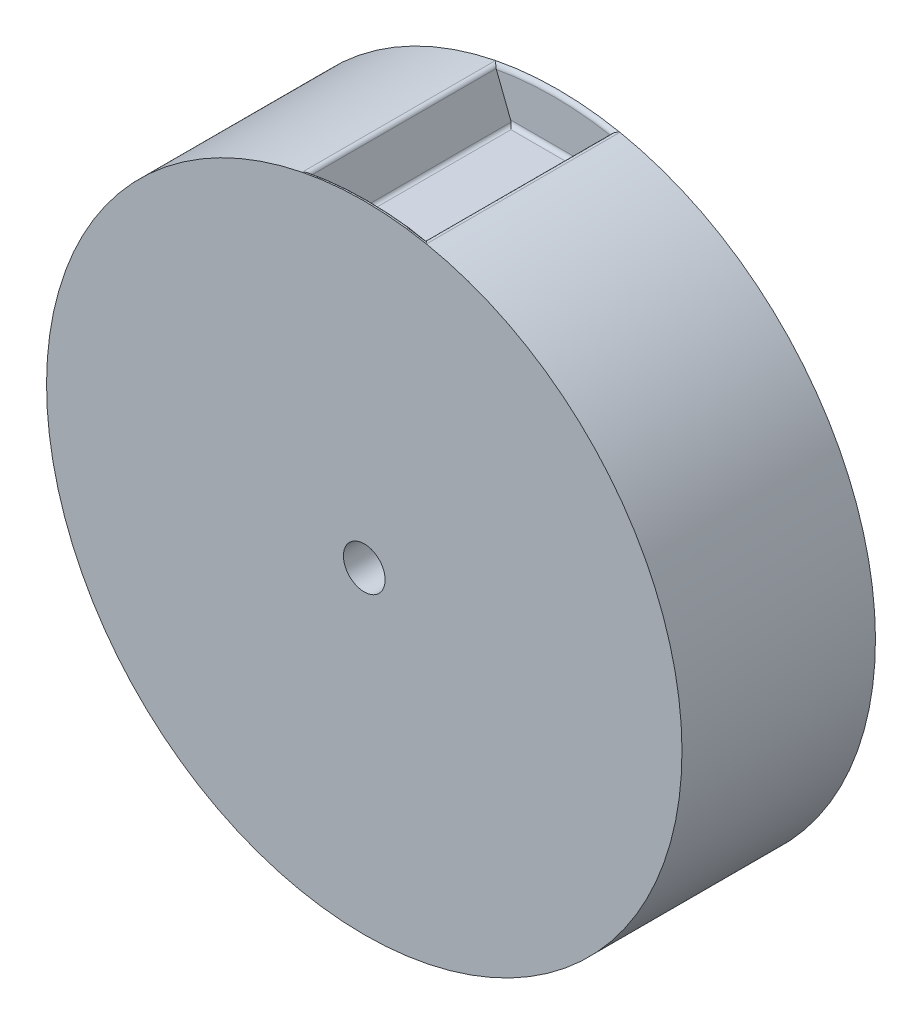
ISO-10303-21;
HEADER;
FILE_DESCRIPTION(('STEP AP214'),'2;1');
FILE_NAME('part.step','',(''),(''),'','','');
FILE_SCHEMA(('AUTOMOTIVE_DESIGN { 1 0 10303 214 1 1 1 1 }'));
ENDSEC;
DATA;
#1=APPLICATION_CONTEXT('core data for automotive mechanical design processes');
#2=APPLICATION_PROTOCOL_DEFINITION('international standard','automotive_design',2000,#1);
#3=PRODUCT_CONTEXT('',#1,'mechanical');
#4=PRODUCT('Part','Part','',(#3));
#5=PRODUCT_RELATED_PRODUCT_CATEGORY('part','',(#4));
#6=PRODUCT_DEFINITION_FORMATION('','',#4);
#7=PRODUCT_DEFINITION_CONTEXT('part definition',#1,'design');
#8=PRODUCT_DEFINITION('design','',#6,#7);
#9=PRODUCT_DEFINITION_SHAPE('','',#8);
#10=(LENGTH_UNIT() NAMED_UNIT(*) SI_UNIT(.MILLI.,.METRE.));
#11=(NAMED_UNIT(*) PLANE_ANGLE_UNIT() SI_UNIT($,.RADIAN.));
#12=(NAMED_UNIT(*) SI_UNIT($,.STERADIAN.) SOLID_ANGLE_UNIT());
#13=UNCERTAINTY_MEASURE_WITH_UNIT(LENGTH_MEASURE(1.E-05),#10,'distance_accuracy_value','');
#14=(GEOMETRIC_REPRESENTATION_CONTEXT(3) GLOBAL_UNCERTAINTY_ASSIGNED_CONTEXT((#13)) GLOBAL_UNIT_ASSIGNED_CONTEXT((#10,
#11,#12)) REPRESENTATION_CONTEXT('',''));
#15=CARTESIAN_POINT('',(0.,0.,0.));
#16=DIRECTION('',(0.,0.,1.));
#17=DIRECTION('',(1.,0.,0.));
#18=AXIS2_PLACEMENT_3D('',#15,#16,#17);
#19=CARTESIAN_POINT('',(0.,0.,22.2));
#20=DIRECTION('',(0.,0.,-1.));
#21=DIRECTION('',(-1.,0.,0.));
#22=AXIS2_PLACEMENT_3D('',#19,#20,#21);
#23=CYLINDRICAL_SURFACE('',#22,38.1);
#24=CARTESIAN_POINT('',(0.,0.,-0.5));
#25=DIRECTION('',(0.,0.,-1.));
#26=DIRECTION('',(-1.,0.,0.));
#27=AXIS2_PLACEMENT_3D('',#24,#25,#26);
#28=CIRCLE('',#27,38.1);
#29=CARTESIAN_POINT('',(7.45272481238406,37.3639785471365,-0.5));
#30=VERTEX_POINT('',#29);
#31=CARTESIAN_POINT('',(-7.45272481238408,37.3639785471365,-0.5));
#32=VERTEX_POINT('',#31);
#33=EDGE_CURVE('E334',#30,#32,#28,.T.);
#34=ORIENTED_EDGE('',*,*,#33,.F.);
#35=DIRECTION('',(0.,0.,-1.));
#36=VECTOR('',#35,1.);
#37=CARTESIAN_POINT('',(7.45272481238406,37.3639785471365,22.2));
#38=LINE('',#37,#36);
#39=CARTESIAN_POINT('',(7.45272481238403,37.3639785471363,22.7));
#40=VERTEX_POINT('',#39);
#41=EDGE_CURVE('E212',#30,#40,#38,.F.);
#42=ORIENTED_EDGE('',*,*,#41,.T.);
#43=CARTESIAN_POINT('',(0.,0.,22.7));
#44=DIRECTION('',(0.,0.,1.));
#45=DIRECTION('',(1.,0.,0.));
#46=AXIS2_PLACEMENT_3D('',#43,#44,#45);
#47=CIRCLE('',#46,38.0999999999999);
#48=CARTESIAN_POINT('',(-7.45272481238405,37.3639785471363,22.7));
#49=VERTEX_POINT('',#48);
#50=EDGE_CURVE('E341',#49,#40,#47,.T.);
#51=ORIENTED_EDGE('',*,*,#50,.F.);
#52=DIRECTION('',(0.,0.,-1.));
#53=VECTOR('',#52,1.);
#54=CARTESIAN_POINT('',(-7.45272481238408,37.3639785471365,22.2));
#55=LINE('',#54,#53);
#56=EDGE_CURVE('E209',#49,#32,#55,.T.);
#57=ORIENTED_EDGE('',*,*,#56,.T.);
#58=EDGE_LOOP('',(#34,#42,#51,#57));
#59=FACE_BOUND('',#58,.T.);
#60=ADVANCED_FACE('F41',(#59),#23,.T.);
#61=CARTESIAN_POINT('',(0.,0.,0.));
#62=DIRECTION('',(0.,0.,1.));
#63=DIRECTION('',(1.,0.,0.));
#64=AXIS2_PLACEMENT_3D('',#61,#62,#63);
#65=CYLINDRICAL_SURFACE('',#64,2.5);
#66=CARTESIAN_POINT('',(0.,0.,-0.5));
#67=DIRECTION('',(0.,0.,-1.));
#68=DIRECTION('',(-1.,0.,0.));
#69=AXIS2_PLACEMENT_3D('',#66,#67,#68);
#70=CIRCLE('',#69,2.50000000000008);
#71=CARTESIAN_POINT('',(-2.50000000000008,0.,-0.5));
#72=VERTEX_POINT('',#71);
#73=EDGE_CURVE('E335',#72,#72,#70,.T.);
#74=ORIENTED_EDGE('',*,*,#73,.T.);
#75=EDGE_LOOP('',(#74));
#76=FACE_BOUND('',#75,.T.);
#77=CARTESIAN_POINT('',(0.,0.,22.7));
#78=DIRECTION('',(0.,0.,1.));
#79=DIRECTION('',(1.,0.,0.));
#80=AXIS2_PLACEMENT_3D('',#77,#78,#79);
#81=CIRCLE('',#80,2.5);
#82=CARTESIAN_POINT('',(2.49999999999999,0.,22.7));
#83=VERTEX_POINT('',#82);
#84=EDGE_CURVE('E261',#83,#83,#81,.T.);
#85=ORIENTED_EDGE('',*,*,#84,.T.);
#86=EDGE_LOOP('',(#85));
#87=FACE_BOUND('',#86,.T.);
#88=ADVANCED_FACE('F360',(#76,#87),#65,.F.);
#89=CARTESIAN_POINT('',(7.04072332355369,37.4438007563491,-165.282496159998));
#90=DIRECTION('',(-0.93155768306813,0.363593568585499,0.));
#91=DIRECTION('',(-0.363593568585499,-0.93155768306813,0.));
#92=AXIS2_PLACEMENT_3D('',#89,#90,#91);
#93=PLANE('',#92);
#94=CARTESIAN_POINT('',(6.85568313824751,36.9697120452398,22.2));
#95=CARTESIAN_POINT('',(6.8613040944813,36.9841134137408,22.2000023833874));
#96=CARTESIAN_POINT('',(6.86690274277895,36.9984576274098,22.2006900906611));
#97=CARTESIAN_POINT('',(6.87805542446613,37.0270317475542,22.2034361532184));
#98=CARTESIAN_POINT('',(6.88360945784794,37.0412616540098,22.205494508739));
#99=CARTESIAN_POINT('',(6.8891411832859,37.0554344056138,22.2082381883827));
#100=B_SPLINE_CURVE_WITH_KNOTS('',3,(#94,#95,#96,#97,#98,#99),.UNSPECIFIED.,.F.,.F.,(4,2,4),(0.,
0.046240333352358,0.0924806746997725),.UNSPECIFIED.);
#101=CARTESIAN_POINT('',(6.85568313824751,36.9697120452398,22.2));
#102=VERTEX_POINT('',#101);
#103=CARTESIAN_POINT('',(6.8891411832859,37.0554344056138,22.2082381883827));
#104=VERTEX_POINT('',#103);
#105=EDGE_CURVE('E224',#102,#104,#100,.T.);
#106=ORIENTED_EDGE('',*,*,#105,.T.);
#107=DIRECTION('',(0.,0.,1.));
#108=VECTOR('',#107,1.);
#109=CARTESIAN_POINT('',(6.8891411832859,37.0554344056138,0.));
#110=LINE('',#109,#108);
#111=CARTESIAN_POINT('',(6.8891411832859,37.0554344056138,-0.00823818838274421));
#112=VERTEX_POINT('',#111);
#113=EDGE_CURVE('E71',#104,#112,#110,.F.);
#114=ORIENTED_EDGE('',*,*,#113,.T.);
#115=CARTESIAN_POINT('',(6.8891411832859,37.0554344056138,-0.00823818838274421));
#116=CARTESIAN_POINT('',(6.88360945784794,37.0412616540098,-0.00549450873897013));
#117=CARTESIAN_POINT('',(6.87805542446613,37.0270317475542,-0.00343615321840758));
#118=CARTESIAN_POINT('',(6.86690274277896,36.9984576274098,-0.000690090661105329));
#119=CARTESIAN_POINT('',(6.86130409448131,36.9841134137408,-2.38338737790063E-06));
#120=CARTESIAN_POINT('',(6.85568313824752,36.9697120452398,1.25728203115433E-13));
#121=B_SPLINE_CURVE_WITH_KNOTS('',3,(#115,#116,#117,#118,#119,#120),.UNSPECIFIED.,.F.,.F.,(4,2,
4),(0.,0.0462403413474005,0.092480674699756),.UNSPECIFIED.);
#122=CARTESIAN_POINT('',(6.85568313824751,36.9697120452398,0.));
#123=VERTEX_POINT('',#122);
#124=EDGE_CURVE('E56',#112,#123,#121,.T.);
#125=ORIENTED_EDGE('',*,*,#124,.T.);
#126=DIRECTION('',(-0.363593568585499,-0.93155768306813,0.));
#127=VECTOR('',#126,1.);
#128=CARTESIAN_POINT('',(-6.57259147563583,2.56532905360224,0.));
#129=LINE('',#128,#127);
#130=CARTESIAN_POINT('',(5.15015354507515,32.6,0.));
#131=VERTEX_POINT('',#130);
#132=EDGE_CURVE('E161',#123,#131,#129,.T.);
#133=ORIENTED_EDGE('',*,*,#132,.T.);
#134=CARTESIAN_POINT('',(5.15015354507515,32.6,0.5));
#135=DIRECTION('',(-0.93155768306813,0.363593568585499,0.));
#136=DIRECTION('',(-0.363593568585499,-0.93155768306813,0.));
#137=AXIS2_PLACEMENT_3D('',#134,#135,#136);
#138=ELLIPSE('',#137,0.536735415410054,0.5);
#139=CARTESIAN_POINT('',(5.07919697119916,32.4182032157073,0.0342211584659358));
#140=VERTEX_POINT('',#139);
#141=EDGE_CURVE('E197',#131,#140,#138,.T.);
#142=ORIENTED_EDGE('',*,*,#141,.T.);
#143=DIRECTION('',(0.,0.,1.));
#144=VECTOR('',#143,1.);
#145=CARTESIAN_POINT('',(5.07919697119916,32.4182032157073,22.2));
#146=LINE('',#145,#144);
#147=CARTESIAN_POINT('',(5.07919697119916,32.4182032157073,22.1657788415341));
#148=VERTEX_POINT('',#147);
#149=EDGE_CURVE('E191',#140,#148,#146,.T.);
#150=ORIENTED_EDGE('',*,*,#149,.T.);
#151=CARTESIAN_POINT('',(5.15015354507515,32.6,21.7));
#152=DIRECTION('',(-0.93155768306813,0.363593568585499,0.));
#153=DIRECTION('',(-0.363593568585499,-0.93155768306813,0.));
#154=AXIS2_PLACEMENT_3D('',#151,#152,#153);
#155=ELLIPSE('',#154,0.536735415410054,0.5);
#156=CARTESIAN_POINT('',(5.15015354507515,32.6,22.2));
#157=VERTEX_POINT('',#156);
#158=EDGE_CURVE('E194',#148,#157,#155,.T.);
#159=ORIENTED_EDGE('',*,*,#158,.T.);
#160=DIRECTION('',(-0.363593568585499,-0.93155768306813,0.));
#161=VECTOR('',#160,1.);
#162=CARTESIAN_POINT('',(-6.57259147563583,2.56532905360224,22.2));
#163=LINE('',#162,#161);
#164=EDGE_CURVE('E306',#102,#157,#163,.T.);
#165=ORIENTED_EDGE('',*,*,#164,.F.);
#166=EDGE_LOOP('',(#106,#114,#125,#133,#142,#150,#159,#165));
#167=FACE_BOUND('',#166,.T.);
#168=ADVANCED_FACE('F304',(#167),#93,.T.);
#169=CARTESIAN_POINT('',(4.95499999999999,32.1,-165.282496159998));
#170=DIRECTION('',(0.,1.,0.));
#171=DIRECTION('',(0.,0.,1.));
#172=AXIS2_PLACEMENT_3D('',#169,#170,#171);
#173=PLANE('',#172);
#174=DIRECTION('',(-1.,0.,0.));
#175=VECTOR('',#174,1.);
#176=CARTESIAN_POINT('',(4.95499999999999,32.1,21.7));
#177=LINE('',#176,#175);
#178=CARTESIAN_POINT('',(-4.61341812966513,32.1,21.7));
#179=VERTEX_POINT('',#178);
#180=CARTESIAN_POINT('',(4.61341812966509,32.1,21.7));
#181=VERTEX_POINT('',#180);
#182=EDGE_CURVE('E160',#179,#181,#177,.F.);
#183=ORIENTED_EDGE('',*,*,#182,.T.);
#184=DIRECTION('',(0.,0.,1.));
#185=VECTOR('',#184,1.);
#186=CARTESIAN_POINT('',(4.61341812966509,32.1,0.));
#187=LINE('',#186,#185);
#188=CARTESIAN_POINT('',(4.61341812966509,32.1,0.5));
#189=VERTEX_POINT('',#188);
#190=EDGE_CURVE('E165',#181,#189,#187,.F.);
#191=ORIENTED_EDGE('',*,*,#190,.T.);
#192=DIRECTION('',(-1.,0.,0.));
#193=VECTOR('',#192,1.);
#194=CARTESIAN_POINT('',(4.95499999999999,32.1,0.5));
#195=LINE('',#194,#193);
#196=CARTESIAN_POINT('',(-4.61341812966513,32.1,0.5));
#197=VERTEX_POINT('',#196);
#198=EDGE_CURVE('E144',#189,#197,#195,.T.);
#199=ORIENTED_EDGE('',*,*,#198,.T.);
#200=DIRECTION('',(0.,0.,1.));
#201=VECTOR('',#200,1.);
#202=CARTESIAN_POINT('',(-4.61341812966513,32.1,22.2));
#203=LINE('',#202,#201);
#204=EDGE_CURVE('E153',#197,#179,#203,.T.);
#205=ORIENTED_EDGE('',*,*,#204,.T.);
#206=EDGE_LOOP('',(#183,#191,#199,#205));
#207=FACE_BOUND('',#206,.T.);
#208=ADVANCED_FACE('F163',(#207),#173,.T.);
#209=CARTESIAN_POINT('',(-4.95500000000002,32.1,-165.282496159998));
#210=DIRECTION('',(0.93155768306813,0.363593568585498,0.));
#211=DIRECTION('',(-0.363593568585498,0.93155768306813,0.));
#212=AXIS2_PLACEMENT_3D('',#209,#210,#211);
#213=PLANE('',#212);
#214=CARTESIAN_POINT('',(-6.85568313824753,36.9697120452398,0.));
#215=CARTESIAN_POINT('',(-6.86130409448132,36.9841134137408,-2.38338744071117E-06));
#216=CARTESIAN_POINT('',(-6.86690274277897,36.9984576274098,-0.000690090661126024));
#217=CARTESIAN_POINT('',(-6.87805542446615,37.0270317475542,-0.00343615321838601));
#218=CARTESIAN_POINT('',(-6.88360945784796,37.0412616540098,-0.00549450873894877));
#219=CARTESIAN_POINT('',(-6.88914118328592,37.0554344056138,-0.00823818838274422));
#220=B_SPLINE_CURVE_WITH_KNOTS('',3,(#214,#215,#216,#217,#218,#219),.UNSPECIFIED.,.F.,.F.,(4,2,
4),(0.,0.0462403333523576,0.0924806746997723),.UNSPECIFIED.);
#221=CARTESIAN_POINT('',(-6.85568313824753,36.9697120452398,0.));
#222=VERTEX_POINT('',#221);
#223=CARTESIAN_POINT('',(-6.88914118328592,37.0554344056138,-0.0082381883827442));
#224=VERTEX_POINT('',#223);
#225=EDGE_CURVE('E11',#222,#224,#220,.T.);
#226=ORIENTED_EDGE('',*,*,#225,.T.);
#227=DIRECTION('',(0.,0.,1.));
#228=VECTOR('',#227,1.);
#229=CARTESIAN_POINT('',(-6.88914118328592,37.0554344056138,22.2));
#230=LINE('',#229,#228);
#231=CARTESIAN_POINT('',(-6.88914118328592,37.0554344056138,22.2082381883827));
#232=VERTEX_POINT('',#231);
#233=EDGE_CURVE('E64',#224,#232,#230,.T.);
#234=ORIENTED_EDGE('',*,*,#233,.T.);
#235=CARTESIAN_POINT('',(-6.88914118328592,37.0554344056138,22.2082381883827));
#236=CARTESIAN_POINT('',(-6.88360945784796,37.0412616540098,22.205494508739));
#237=CARTESIAN_POINT('',(-6.87805542446615,37.0270317475542,22.2034361532184));
#238=CARTESIAN_POINT('',(-6.86690274277898,36.9984576274098,22.2006900906611));
#239=CARTESIAN_POINT('',(-6.86130409448133,36.9841134137408,22.2000023833874));
#240=CARTESIAN_POINT('',(-6.85568313824754,36.9697120452398,22.1999999999999));
#241=B_SPLINE_CURVE_WITH_KNOTS('',3,(#235,#236,#237,#238,#239,#240),.UNSPECIFIED.,.F.,.F.,(4,2,
4),(0.,0.0462403413474004,0.092480674699756),.UNSPECIFIED.);
#242=CARTESIAN_POINT('',(-6.85568313824753,36.9697120452398,22.2));
#243=VERTEX_POINT('',#242);
#244=EDGE_CURVE('E215',#232,#243,#241,.T.);
#245=ORIENTED_EDGE('',*,*,#244,.T.);
#246=DIRECTION('',(-0.363593568585498,0.93155768306813,0.));
#247=VECTOR('',#246,1.);
#248=CARTESIAN_POINT('',(6.57259147563576,2.56532905360221,22.2));
#249=LINE('',#248,#247);
#250=CARTESIAN_POINT('',(-5.15015354507518,32.6,22.2));
#251=VERTEX_POINT('',#250);
#252=EDGE_CURVE('E324',#251,#243,#249,.T.);
#253=ORIENTED_EDGE('',*,*,#252,.F.);
#254=CARTESIAN_POINT('',(-5.15015354507518,32.6,21.7));
#255=DIRECTION('',(0.93155768306813,0.363593568585498,0.));
#256=DIRECTION('',(-0.363593568585498,0.93155768306813,0.));
#257=AXIS2_PLACEMENT_3D('',#254,#255,#256);
#258=ELLIPSE('',#257,0.536735415410054,0.5);
#259=CARTESIAN_POINT('',(-5.07919697119919,32.4182032157073,22.1657788415341));
#260=VERTEX_POINT('',#259);
#261=EDGE_CURVE('E177',#251,#260,#258,.T.);
#262=ORIENTED_EDGE('',*,*,#261,.T.);
#263=DIRECTION('',(0.,0.,1.));
#264=VECTOR('',#263,1.);
#265=CARTESIAN_POINT('',(-5.07919697119919,32.4182032157073,0.));
#266=LINE('',#265,#264);
#267=CARTESIAN_POINT('',(-5.07919697119919,32.4182032157073,0.0342211584659346));
#268=VERTEX_POINT('',#267);
#269=EDGE_CURVE('E171',#260,#268,#266,.F.);
#270=ORIENTED_EDGE('',*,*,#269,.T.);
#271=CARTESIAN_POINT('',(-5.15015354507518,32.6,0.5));
#272=DIRECTION('',(0.93155768306813,0.363593568585498,0.));
#273=DIRECTION('',(-0.363593568585498,0.93155768306813,0.));
#274=AXIS2_PLACEMENT_3D('',#271,#272,#273);
#275=ELLIPSE('',#274,0.536735415410054,0.5);
#276=CARTESIAN_POINT('',(-5.15015354507518,32.6,0.));
#277=VERTEX_POINT('',#276);
#278=EDGE_CURVE('E146',#268,#277,#275,.T.);
#279=ORIENTED_EDGE('',*,*,#278,.T.);
#280=DIRECTION('',(-0.363593568585498,0.93155768306813,0.));
#281=VECTOR('',#280,1.);
#282=CARTESIAN_POINT('',(6.57259147563576,2.56532905360221,0.));
#283=LINE('',#282,#281);
#284=EDGE_CURVE('E317',#277,#222,#283,.T.);
#285=ORIENTED_EDGE('',*,*,#284,.T.);
#286=EDGE_LOOP('',(#226,#234,#245,#253,#262,#270,#279,#285));
#287=FACE_BOUND('',#286,.T.);
#288=ADVANCED_FACE('F234',(#287),#213,.T.);
#289=CARTESIAN_POINT('',(0.,0.,-0.5));
#290=DIRECTION('',(0.,0.,-1.));
#291=DIRECTION('',(-1.,0.,0.));
#292=AXIS2_PLACEMENT_3D('',#289,#290,#291);
#293=PLANE('',#292);
#294=EDGE_CURVE('E330',#32,#30,#28,.T.);
#295=ORIENTED_EDGE('',*,*,#294,.T.);
#296=ORIENTED_EDGE('',*,*,#33,.T.);
#297=EDGE_LOOP('',(#295,#296));
#298=FACE_BOUND('',#297,.T.);
#299=ORIENTED_EDGE('',*,*,#73,.F.);
#300=EDGE_LOOP('',(#299));
#301=FACE_BOUND('',#300,.T.);
#302=ADVANCED_FACE('F239',(#298,#301),#293,.T.);
#303=CARTESIAN_POINT('',(0.,0.,0.));
#304=DIRECTION('',(0.,0.,-1.));
#305=DIRECTION('',(-1.,0.,0.));
#306=AXIS2_PLACEMENT_3D('',#303,#304,#305);
#307=PLANE('',#306);
#308=ORIENTED_EDGE('',*,*,#284,.F.);
#309=DIRECTION('',(-1.,0.,0.));
#310=VECTOR('',#309,1.);
#311=CARTESIAN_POINT('',(0.,32.6,0.));
#312=LINE('',#311,#310);
#313=EDGE_CURVE('E187',#277,#131,#312,.F.);
#314=ORIENTED_EDGE('',*,*,#313,.T.);
#315=ORIENTED_EDGE('',*,*,#132,.F.);
#316=CARTESIAN_POINT('',(0.,0.,0.));
#317=DIRECTION('',(0.,0.,-1.));
#318=DIRECTION('',(-1.,0.,0.));
#319=AXIS2_PLACEMENT_3D('',#316,#317,#318);
#320=CIRCLE('',#319,37.6);
#321=EDGE_CURVE('E184',#123,#222,#320,.F.);
#322=ORIENTED_EDGE('',*,*,#321,.T.);
#323=EDGE_LOOP('',(#308,#314,#315,#322));
#324=FACE_BOUND('',#323,.T.);
#325=ADVANCED_FACE('F241',(#324),#307,.F.);
#326=CARTESIAN_POINT('',(0.,0.,22.2));
#327=DIRECTION('',(0.,0.,1.));
#328=DIRECTION('',(1.,0.,0.));
#329=AXIS2_PLACEMENT_3D('',#326,#327,#328);
#330=PLANE('',#329);
#331=ORIENTED_EDGE('',*,*,#164,.T.);
#332=DIRECTION('',(-1.,0.,0.));
#333=VECTOR('',#332,1.);
#334=CARTESIAN_POINT('',(0.,32.6,22.2));
#335=LINE('',#334,#333);
#336=EDGE_CURVE('E206',#157,#251,#335,.T.);
#337=ORIENTED_EDGE('',*,*,#336,.T.);
#338=ORIENTED_EDGE('',*,*,#252,.T.);
#339=CARTESIAN_POINT('',(0.,0.,22.2));
#340=DIRECTION('',(0.,0.,1.));
#341=DIRECTION('',(1.,0.,0.));
#342=AXIS2_PLACEMENT_3D('',#339,#340,#341);
#343=CIRCLE('',#342,37.6);
#344=EDGE_CURVE('E202',#243,#102,#343,.F.);
#345=ORIENTED_EDGE('',*,*,#344,.T.);
#346=EDGE_LOOP('',(#331,#337,#338,#345));
#347=FACE_BOUND('',#346,.T.);
#348=ADVANCED_FACE('F386',(#347),#330,.F.);
#349=CARTESIAN_POINT('',(0.,0.,22.7));
#350=DIRECTION('',(0.,0.,1.));
#351=DIRECTION('',(1.,0.,0.));
#352=AXIS2_PLACEMENT_3D('',#349,#350,#351);
#353=PLANE('',#352);
#354=EDGE_CURVE('E299',#40,#49,#47,.T.);
#355=ORIENTED_EDGE('',*,*,#354,.T.);
#356=ORIENTED_EDGE('',*,*,#50,.T.);
#357=EDGE_LOOP('',(#355,#356));
#358=FACE_BOUND('',#357,.T.);
#359=ORIENTED_EDGE('',*,*,#84,.F.);
#360=EDGE_LOOP('',(#359));
#361=FACE_BOUND('',#360,.T.);
#362=ADVANCED_FACE('F350',(#358,#361),#353,.T.);
#363=CARTESIAN_POINT('',(0.,32.6,21.7));
#364=DIRECTION('',(-1.,0.,0.));
#365=DIRECTION('',(0.,0.,1.));
#366=AXIS2_PLACEMENT_3D('',#363,#364,#365);
#367=CYLINDRICAL_SURFACE('',#366,0.5);
#368=ORIENTED_EDGE('',*,*,#336,.F.);
#369=ORIENTED_EDGE('',*,*,#158,.F.);
#370=CARTESIAN_POINT('',(4.61341812966509,32.6,21.7));
#371=DIRECTION('',(-0.707106781186547,0.,0.707106781186547));
#372=DIRECTION('',(-0.707106781186547,0.,-0.707106781186547));
#373=AXIS2_PLACEMENT_3D('',#370,#371,#372);
#374=ELLIPSE('',#373,0.707106781186547,0.5);
#375=EDGE_CURVE('E257',#181,#148,#374,.T.);
#376=ORIENTED_EDGE('',*,*,#375,.F.);
#377=ORIENTED_EDGE('',*,*,#182,.F.);
#378=CARTESIAN_POINT('',(-4.61341812966513,32.6,21.7));
#379=DIRECTION('',(-0.707106781186547,0.,-0.707106781186547));
#380=DIRECTION('',(-0.707106781186547,0.,0.707106781186547));
#381=AXIS2_PLACEMENT_3D('',#378,#379,#380);
#382=ELLIPSE('',#381,0.707106781186547,0.5);
#383=EDGE_CURVE('E156',#260,#179,#382,.F.);
#384=ORIENTED_EDGE('',*,*,#383,.F.);
#385=ORIENTED_EDGE('',*,*,#261,.F.);
#386=EDGE_LOOP('',(#368,#369,#376,#377,#384,#385));
#387=FACE_BOUND('',#386,.T.);
#388=ADVANCED_FACE('F279',(#387),#367,.F.);
#389=CARTESIAN_POINT('',(4.61341812966509,32.6,-165.282496159998));
#390=DIRECTION('',(0.,0.,-1.));
#391=DIRECTION('',(-1.,0.,0.));
#392=AXIS2_PLACEMENT_3D('',#389,#390,#391);
#393=CYLINDRICAL_SURFACE('',#392,0.5);
#394=ORIENTED_EDGE('',*,*,#375,.T.);
#395=ORIENTED_EDGE('',*,*,#149,.F.);
#396=CARTESIAN_POINT('',(4.61341812966509,32.6,0.5));
#397=DIRECTION('',(-0.707106781186547,0.,-0.707106781186547));
#398=DIRECTION('',(-0.707106781186547,0.,0.707106781186547));
#399=AXIS2_PLACEMENT_3D('',#396,#397,#398);
#400=ELLIPSE('',#399,0.707106781186547,0.5);
#401=EDGE_CURVE('E150',#189,#140,#400,.F.);
#402=ORIENTED_EDGE('',*,*,#401,.F.);
#403=ORIENTED_EDGE('',*,*,#190,.F.);
#404=EDGE_LOOP('',(#394,#395,#402,#403));
#405=FACE_BOUND('',#404,.T.);
#406=ADVANCED_FACE('F373',(#405),#393,.F.);
#407=CARTESIAN_POINT('',(-4.61341812966513,32.6,-165.282496159998));
#408=DIRECTION('',(0.,0.,-1.));
#409=DIRECTION('',(-1.,0.,0.));
#410=AXIS2_PLACEMENT_3D('',#407,#408,#409);
#411=CYLINDRICAL_SURFACE('',#410,0.5);
#412=ORIENTED_EDGE('',*,*,#383,.T.);
#413=ORIENTED_EDGE('',*,*,#204,.F.);
#414=CARTESIAN_POINT('',(-4.61341812966513,32.6,0.5));
#415=DIRECTION('',(-0.707106781186547,0.,0.707106781186547));
#416=DIRECTION('',(-0.707106781186547,0.,-0.707106781186547));
#417=AXIS2_PLACEMENT_3D('',#414,#415,#416);
#418=ELLIPSE('',#417,0.707106781186547,0.5);
#419=EDGE_CURVE('E139',#268,#197,#418,.T.);
#420=ORIENTED_EDGE('',*,*,#419,.F.);
#421=ORIENTED_EDGE('',*,*,#269,.F.);
#422=EDGE_LOOP('',(#412,#413,#420,#421));
#423=FACE_BOUND('',#422,.T.);
#424=ADVANCED_FACE('F154',(#423),#411,.F.);
#425=CARTESIAN_POINT('',(4.95499999999999,32.6,0.5));
#426=DIRECTION('',(-1.,0.,0.));
#427=DIRECTION('',(0.,0.,1.));
#428=AXIS2_PLACEMENT_3D('',#425,#426,#427);
#429=CYLINDRICAL_SURFACE('',#428,0.5);
#430=ORIENTED_EDGE('',*,*,#141,.F.);
#431=ORIENTED_EDGE('',*,*,#313,.F.);
#432=ORIENTED_EDGE('',*,*,#278,.F.);
#433=ORIENTED_EDGE('',*,*,#419,.T.);
#434=ORIENTED_EDGE('',*,*,#198,.F.);
#435=ORIENTED_EDGE('',*,*,#401,.T.);
#436=EDGE_LOOP('',(#430,#431,#432,#433,#434,#435));
#437=FACE_BOUND('',#436,.T.);
#438=ADVANCED_FACE('F141',(#437),#429,.F.);
#439=CARTESIAN_POINT('',(0.,0.,-0.5));
#440=DIRECTION('',(0.,0.,-1.));
#441=DIRECTION('',(-1.,0.,0.));
#442=AXIS2_PLACEMENT_3D('',#439,#440,#441);
#443=TOROIDAL_SURFACE('',#442,37.6,0.5);
#444=ORIENTED_EDGE('',*,*,#321,.F.);
#445=ORIENTED_EDGE('',*,*,#124,.F.);
#446=CARTESIAN_POINT('',(6.8891411832859,37.0554344056138,-0.00823818838274421));
#447=CARTESIAN_POINT('',(6.89828596283227,37.0789273819579,-0.0127682705761249));
#448=CARTESIAN_POINT('',(6.90907852326786,37.1012824440639,-0.019123380144007));
#449=CARTESIAN_POINT('',(6.93312562589764,37.1431931119808,-0.0347609301089902));
#450=CARTESIAN_POINT('',(6.94635376891849,37.162775089683,-0.0440126635340287));
#451=CARTESIAN_POINT('',(6.97457281186448,37.1990044381379,-0.0647794681585089));
#452=CARTESIAN_POINT('',(6.98955298652556,37.2156682503588,-0.0762810311499763));
#453=CARTESIAN_POINT('',(7.02083186221397,37.2462834389228,-0.101070094769677));
#454=CARTESIAN_POINT('',(7.03713431475674,37.2602266863203,-0.114362752966673));
#455=CARTESIAN_POINT('',(7.0801486279541,37.2926660371758,-0.15023891576358));
#456=CARTESIAN_POINT('',(7.10750133813915,37.3092328726042,-0.173802396504432));
#457=CARTESIAN_POINT('',(7.16324659602929,37.3364844252949,-0.223029576026312));
#458=CARTESIAN_POINT('',(7.19164159824034,37.347154162704,-0.24869843489223));
#459=CARTESIAN_POINT('',(7.25872289650398,37.3659268002564,-0.310539096747695));
#460=CARTESIAN_POINT('',(7.29753363077359,37.3718251788579,-0.347243174971019));
#461=CARTESIAN_POINT('',(7.37438829609864,37.374730921382,-0.421592595537563));
#462=CARTESIAN_POINT('',(7.41243377605592,37.3717585613947,-0.459235596588174));
#463=CARTESIAN_POINT('',(7.45063616810028,37.3643916782991,-0.49788490868717));
#464=CARTESIAN_POINT('',(7.45168084799981,37.3641867695741,-0.498942480905821));
#465=CARTESIAN_POINT('',(7.45272481238406,37.3639785471365,-0.5));
#466=B_SPLINE_CURVE_WITH_KNOTS('',3,(#446,#447,#448,#449,#450,#451,#452,#453,#454,#455,#456,
#457,#458,#459,#460,#461,#462,#463,#464,#465),.UNSPECIFIED.,.F.,.F.,(4,2,2,2,2,2,2,2,2,4),(0.,
0.0765111436159896,0.152237193554066,0.227521808763764,0.30302803795616,0.421534415758462,
0.540340456813169,0.700717786941364,0.860728819180238,0.865230603436553),.UNSPECIFIED.);
#467=EDGE_CURVE('E46',#30,#112,#466,.F.);
#468=ORIENTED_EDGE('',*,*,#467,.F.);
#469=ORIENTED_EDGE('',*,*,#294,.F.);
#470=CARTESIAN_POINT('',(-6.88914118328592,37.0554344056138,-0.0082381883827442));
#471=CARTESIAN_POINT('',(-6.89828596283229,37.0789273819579,-0.0127682705761256));
#472=CARTESIAN_POINT('',(-6.90907852326788,37.1012824440639,-0.0191233801440075));
#473=CARTESIAN_POINT('',(-6.93312562589766,37.1431931119808,-0.03476093010899));
#474=CARTESIAN_POINT('',(-6.94635376891851,37.162775089683,-0.0440126635340282));
#475=CARTESIAN_POINT('',(-6.9745728118645,37.1990044381379,-0.0647794681585089));
#476=CARTESIAN_POINT('',(-6.98955298652558,37.2156682503588,-0.076281031149977));
#477=CARTESIAN_POINT('',(-7.020831862214,37.2462834389228,-0.10107009476967));
#478=CARTESIAN_POINT('',(-7.03713431475676,37.2602266863203,-0.114362752966659));
#479=CARTESIAN_POINT('',(-7.08014862795411,37.2926660371758,-0.150238915763591));
#480=CARTESIAN_POINT('',(-7.10750133813911,37.3092328726042,-0.173802396504504));
#481=CARTESIAN_POINT('',(-7.16324659602939,37.3364844252949,-0.223029576026237));
#482=CARTESIAN_POINT('',(-7.19164159824063,37.3471541627039,-0.248698434891949));
#483=CARTESIAN_POINT('',(-7.25872289650363,37.3659268002564,-0.310539096748073));
#484=CARTESIAN_POINT('',(-7.297533630772,37.3718251788583,-0.347243174972666));
#485=CARTESIAN_POINT('',(-7.37438829610028,37.3747309213817,-0.421592595535903));
#486=CARTESIAN_POINT('',(-7.41243377606201,37.3717585613936,-0.459235596581952));
#487=CARTESIAN_POINT('',(-7.45063616810064,37.364391678299,-0.497884908686823));
#488=CARTESIAN_POINT('',(-7.45168084800001,37.364186769574,-0.498942480905643));
#489=CARTESIAN_POINT('',(-7.45272481238408,37.3639785471365,-0.5));
#490=B_SPLINE_CURVE_WITH_KNOTS('',3,(#470,#471,#472,#473,#474,#475,#476,#477,#478,#479,#480,
#481,#482,#483,#484,#485,#486,#487,#488,#489),.UNSPECIFIED.,.F.,.F.,(4,2,2,2,2,2,2,2,2,4),(0.,
0.0765111436159882,0.152237193554065,0.227521808763761,0.303028037956158,0.421534415758463,
0.540340456813166,0.700717786941363,0.860728819180238,0.865230603436556),.UNSPECIFIED.);
#491=EDGE_CURVE('E282',#224,#32,#490,.T.);
#492=ORIENTED_EDGE('',*,*,#491,.F.);
#493=ORIENTED_EDGE('',*,*,#225,.F.);
#494=EDGE_LOOP('',(#444,#445,#468,#469,#492,#493));
#495=FACE_BOUND('',#494,.T.);
#496=ADVANCED_FACE('F43',(#495),#443,.T.);
#497=CARTESIAN_POINT('',(7.35492002481996,36.873637621321,22.2));
#498=DIRECTION('',(0.,0.,-1.));
#499=DIRECTION('',(-1.,0.,0.));
#500=AXIS2_PLACEMENT_3D('',#497,#498,#499);
#501=CYLINDRICAL_SURFACE('',#500,0.5);
#502=ORIENTED_EDGE('',*,*,#113,.F.);
#503=CARTESIAN_POINT('',(6.8891411832859,37.0554344056138,22.2082381883827));
#504=CARTESIAN_POINT('',(6.89828596283227,37.0789273819579,22.2127682705761));
#505=CARTESIAN_POINT('',(6.90907852326786,37.1012824440639,22.219123380144));
#506=CARTESIAN_POINT('',(6.93312562589764,37.1431931119808,22.234760930109));
#507=CARTESIAN_POINT('',(6.94635376891849,37.162775089683,22.244012663534));
#508=CARTESIAN_POINT('',(6.97457281186448,37.1990044381379,22.2647794681585));
#509=CARTESIAN_POINT('',(6.98955298652556,37.2156682503588,22.27628103115));
#510=CARTESIAN_POINT('',(7.02083186221398,37.2462834389228,22.3010700947697));
#511=CARTESIAN_POINT('',(7.03713431475675,37.2602266863203,22.3143627529667));
#512=CARTESIAN_POINT('',(7.08014862795408,37.2926660371758,22.3502389157636));
#513=CARTESIAN_POINT('',(7.10750133813905,37.3092328726042,22.3738023965045));
#514=CARTESIAN_POINT('',(7.1632465960294,37.3364844252949,22.4230295760262));
#515=CARTESIAN_POINT('',(7.19164159824075,37.3471541627039,22.4486984348918));
#516=CARTESIAN_POINT('',(7.25872289650342,37.3659268002565,22.5105390967483));
#517=CARTESIAN_POINT('',(7.29753363077114,37.3718251788584,22.5472431749735));
#518=CARTESIAN_POINT('',(7.37438829610111,37.3747309213815,22.621592595535));
#519=CARTESIAN_POINT('',(7.41243377606517,37.371758561393,22.6592355965787));
#520=CARTESIAN_POINT('',(7.45063616810079,37.364391678299,22.6978849086866));
#521=CARTESIAN_POINT('',(7.45168084800008,37.364186769574,22.6989424809056));
#522=CARTESIAN_POINT('',(7.45272481238406,37.3639785471365,22.7));
#523=B_SPLINE_CURVE_WITH_KNOTS('',3,(#503,#504,#505,#506,#507,#508,#509,#510,#511,#512,#513,
#514,#515,#516,#517,#518,#519,#520,#521,#522),.UNSPECIFIED.,.F.,.F.,(4,2,2,2,2,2,2,2,2,4),(0.,
0.0765111436159883,0.152237193554066,0.22752180876377,0.303028037956161,0.421534415758465,
0.54034045681317,0.700717786941368,0.860728819180237,0.865230603436556),.UNSPECIFIED.);
#524=EDGE_CURVE('E269',#40,#104,#523,.F.);
#525=ORIENTED_EDGE('',*,*,#524,.F.);
#526=ORIENTED_EDGE('',*,*,#41,.F.);
#527=ORIENTED_EDGE('',*,*,#467,.T.);
#528=EDGE_LOOP('',(#502,#525,#526,#527));
#529=FACE_BOUND('',#528,.T.);
#530=ADVANCED_FACE('F278',(#529),#501,.T.);
#531=CARTESIAN_POINT('',(-7.35492002481998,36.873637621321,22.2));
#532=DIRECTION('',(0.,0.,-1.));
#533=DIRECTION('',(-1.,0.,0.));
#534=AXIS2_PLACEMENT_3D('',#531,#532,#533);
#535=CYLINDRICAL_SURFACE('',#534,0.5);
#536=ORIENTED_EDGE('',*,*,#491,.T.);
#537=ORIENTED_EDGE('',*,*,#56,.F.);
#538=CARTESIAN_POINT('',(-6.88914118328592,37.0554344056138,22.2082381883827));
#539=CARTESIAN_POINT('',(-6.89828596283229,37.0789273819579,22.2127682705761));
#540=CARTESIAN_POINT('',(-6.90907852326788,37.1012824440639,22.219123380144));
#541=CARTESIAN_POINT('',(-6.93312562589766,37.1431931119808,22.234760930109));
#542=CARTESIAN_POINT('',(-6.94635376891851,37.162775089683,22.244012663534));
#543=CARTESIAN_POINT('',(-6.9745728118645,37.1990044381379,22.2647794681585));
#544=CARTESIAN_POINT('',(-6.98955298652558,37.2156682503588,22.27628103115));
#545=CARTESIAN_POINT('',(-7.02083186221399,37.2462834389228,22.3010700947697));
#546=CARTESIAN_POINT('',(-7.03713431475676,37.2602266863203,22.3143627529667));
#547=CARTESIAN_POINT('',(-7.08014862795411,37.2926660371758,22.3502389157636));
#548=CARTESIAN_POINT('',(-7.10750133813911,37.3092328726042,22.3738023965045));
#549=CARTESIAN_POINT('',(-7.16324659602939,37.3364844252949,22.4230295760262));
#550=CARTESIAN_POINT('',(-7.19164159824063,37.3471541627039,22.448698434892));
#551=CARTESIAN_POINT('',(-7.25872289650363,37.3659268002564,22.5105390967481));
#552=CARTESIAN_POINT('',(-7.297533630772,37.3718251788583,22.5472431749727));
#553=CARTESIAN_POINT('',(-7.37438829610029,37.3747309213817,22.6215925955359));
#554=CARTESIAN_POINT('',(-7.41243377606203,37.3717585613935,22.6592355965819));
#555=CARTESIAN_POINT('',(-7.45063616810064,37.364391678299,22.6978849086868));
#556=CARTESIAN_POINT('',(-7.45168084800001,37.364186769574,22.6989424809056));
#557=CARTESIAN_POINT('',(-7.45272481238408,37.3639785471365,22.7));
#558=B_SPLINE_CURVE_WITH_KNOTS('',3,(#538,#539,#540,#541,#542,#543,#544,#545,#546,#547,#548,
#549,#550,#551,#552,#553,#554,#555,#556,#557),.UNSPECIFIED.,.F.,.F.,(4,2,2,2,2,2,2,2,2,4),(0.,
0.0765111436159876,0.152237193554065,0.227521808763762,0.303028037956158,0.421534415758464,
0.540340456813168,0.700717786941368,0.860728819180236,0.865230603436556),.UNSPECIFIED.);
#559=EDGE_CURVE('E262',#232,#49,#558,.T.);
#560=ORIENTED_EDGE('',*,*,#559,.F.);
#561=ORIENTED_EDGE('',*,*,#233,.F.);
#562=EDGE_LOOP('',(#536,#537,#560,#561));
#563=FACE_BOUND('',#562,.T.);
#564=ADVANCED_FACE('F274',(#563),#535,.T.);
#565=CARTESIAN_POINT('',(0.,0.,22.7));
#566=DIRECTION('',(0.,0.,1.));
#567=DIRECTION('',(1.,0.,0.));
#568=AXIS2_PLACEMENT_3D('',#565,#566,#567);
#569=TOROIDAL_SURFACE('',#568,37.6,0.5);
#570=ORIENTED_EDGE('',*,*,#105,.F.);
#571=ORIENTED_EDGE('',*,*,#344,.F.);
#572=ORIENTED_EDGE('',*,*,#244,.F.);
#573=ORIENTED_EDGE('',*,*,#559,.T.);
#574=ORIENTED_EDGE('',*,*,#354,.F.);
#575=ORIENTED_EDGE('',*,*,#524,.T.);
#576=EDGE_LOOP('',(#570,#571,#572,#573,#574,#575));
#577=FACE_BOUND('',#576,.T.);
#578=ADVANCED_FACE('F231',(#577),#569,.T.);
#579=CLOSED_SHELL('',(#60,#88,#168,#208,#288,#302,#325,#348,#362,#388,#406,#424,#438,#496,#530,
#564,#578));
#580=MANIFOLD_SOLID_BREP('B2',#579);
#581=ADVANCED_BREP_SHAPE_REPRESENTATION('',(#18,#580),#14);
#582=SHAPE_DEFINITION_REPRESENTATION(#9,#581);
ENDSEC;
END-ISO-10303-21;
